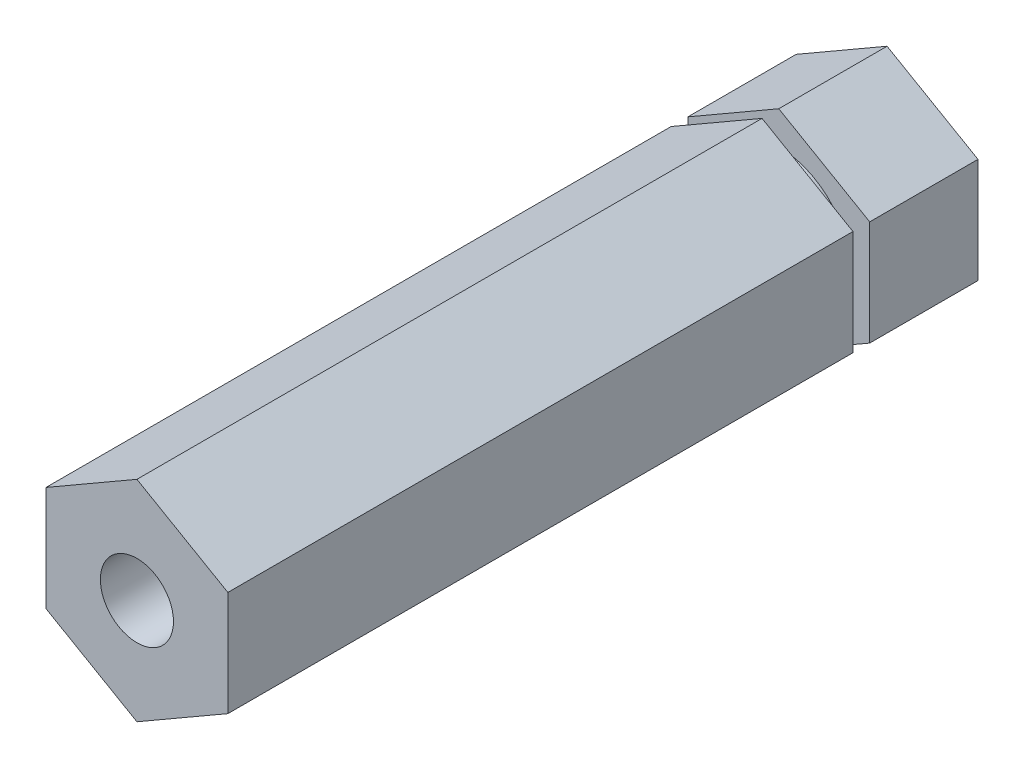
ISO-10303-21;
HEADER;
FILE_DESCRIPTION(('STEP AP214'),'2;1');
FILE_NAME('part.step','',(''),(''),'','','');
FILE_SCHEMA(('AUTOMOTIVE_DESIGN { 1 0 10303 214 1 1 1 1 }'));
ENDSEC;
DATA;
#1=APPLICATION_CONTEXT('core data for automotive mechanical design processes');
#2=APPLICATION_PROTOCOL_DEFINITION('international standard','automotive_design',2000,#1);
#3=PRODUCT_CONTEXT('',#1,'mechanical');
#4=PRODUCT('Part','Part','',(#3));
#5=PRODUCT_RELATED_PRODUCT_CATEGORY('part','',(#4));
#6=PRODUCT_DEFINITION_FORMATION('','',#4);
#7=PRODUCT_DEFINITION_CONTEXT('part definition',#1,'design');
#8=PRODUCT_DEFINITION('design','',#6,#7);
#9=PRODUCT_DEFINITION_SHAPE('','',#8);
#10=(LENGTH_UNIT() NAMED_UNIT(*) SI_UNIT(.MILLI.,.METRE.));
#11=(NAMED_UNIT(*) PLANE_ANGLE_UNIT() SI_UNIT($,.RADIAN.));
#12=(NAMED_UNIT(*) SI_UNIT($,.STERADIAN.) SOLID_ANGLE_UNIT());
#13=UNCERTAINTY_MEASURE_WITH_UNIT(LENGTH_MEASURE(1.E-05),#10,'distance_accuracy_value','');
#14=(GEOMETRIC_REPRESENTATION_CONTEXT(3) GLOBAL_UNCERTAINTY_ASSIGNED_CONTEXT((#13)) GLOBAL_UNIT_ASSIGNED_CONTEXT((#10,
#11,#12)) REPRESENTATION_CONTEXT('',''));
#15=CARTESIAN_POINT('',(0.,0.,0.));
#16=DIRECTION('',(0.,0.,1.));
#17=DIRECTION('',(1.,0.,0.));
#18=AXIS2_PLACEMENT_3D('',#15,#16,#17);
#19=CARTESIAN_POINT('',(0.,7.33234841870825,26.19375));
#20=DIRECTION('',(0.5,-0.866025403784438,0.));
#21=DIRECTION('',(0.866025403784439,0.5,0.));
#22=AXIS2_PLACEMENT_3D('',#19,#20,#21);
#23=PLANE('',#22);
#24=DIRECTION('',(0.,0.,-1.));
#25=VECTOR('',#24,1.);
#26=CARTESIAN_POINT('',(0.,7.33234841870825,26.19375));
#27=LINE('',#26,#25);
#28=CARTESIAN_POINT('',(0.,7.33234841870825,26.19375));
#29=VERTEX_POINT('',#28);
#30=CARTESIAN_POINT('',(0.,7.33234841870825,-17.4625));
#31=VERTEX_POINT('',#30);
#32=EDGE_CURVE('E146',#29,#31,#27,.T.);
#33=ORIENTED_EDGE('',*,*,#32,.T.);
#34=DIRECTION('',(-0.866025403784439,-0.5,0.));
#35=VECTOR('',#34,1.);
#36=CARTESIAN_POINT('',(0.,7.33234841870825,-17.4625));
#37=LINE('',#36,#35);
#38=CARTESIAN_POINT('',(-6.35,3.66617420935412,-17.4625));
#39=VERTEX_POINT('',#38);
#40=EDGE_CURVE('E60',#31,#39,#37,.T.);
#41=ORIENTED_EDGE('',*,*,#40,.T.);
#42=DIRECTION('',(0.,0.,-1.));
#43=VECTOR('',#42,1.);
#44=CARTESIAN_POINT('',(-6.35,3.66617420935412,26.19375));
#45=LINE('',#44,#43);
#46=CARTESIAN_POINT('',(-6.35,3.66617420935412,26.19375));
#47=VERTEX_POINT('',#46);
#48=EDGE_CURVE('E132',#47,#39,#45,.T.);
#49=ORIENTED_EDGE('',*,*,#48,.F.);
#50=DIRECTION('',(-0.866025403784438,-0.5,0.));
#51=VECTOR('',#50,1.);
#52=CARTESIAN_POINT('',(0.,7.33234841870825,26.19375));
#53=LINE('',#52,#51);
#54=EDGE_CURVE('E203',#29,#47,#53,.T.);
#55=ORIENTED_EDGE('',*,*,#54,.F.);
#56=EDGE_LOOP('',(#33,#41,#49,#55));
#57=FACE_BOUND('',#56,.T.);
#58=ADVANCED_FACE('F37',(#57),#23,.F.);
#59=CARTESIAN_POINT('',(-6.35,3.66617420935412,26.19375));
#60=DIRECTION('',(1.,0.,0.));
#61=DIRECTION('',(0.,0.,-1.));
#62=AXIS2_PLACEMENT_3D('',#59,#60,#61);
#63=PLANE('',#62);
#64=ORIENTED_EDGE('',*,*,#48,.T.);
#65=DIRECTION('',(0.,-1.,0.));
#66=VECTOR('',#65,1.);
#67=CARTESIAN_POINT('',(-6.35,3.66617420935413,-17.4625));
#68=LINE('',#67,#66);
#69=CARTESIAN_POINT('',(-6.35,-3.66617420935412,-17.4625));
#70=VERTEX_POINT('',#69);
#71=EDGE_CURVE('E228',#39,#70,#68,.T.);
#72=ORIENTED_EDGE('',*,*,#71,.T.);
#73=DIRECTION('',(0.,0.,-1.));
#74=VECTOR('',#73,1.);
#75=CARTESIAN_POINT('',(-6.35,-3.66617420935412,26.19375));
#76=LINE('',#75,#74);
#77=CARTESIAN_POINT('',(-6.35,-3.66617420935412,26.19375));
#78=VERTEX_POINT('',#77);
#79=EDGE_CURVE('E168',#78,#70,#76,.T.);
#80=ORIENTED_EDGE('',*,*,#79,.F.);
#81=DIRECTION('',(0.,-1.,0.));
#82=VECTOR('',#81,1.);
#83=CARTESIAN_POINT('',(-6.35,3.66617420935412,26.19375));
#84=LINE('',#83,#82);
#85=EDGE_CURVE('E205',#47,#78,#84,.T.);
#86=ORIENTED_EDGE('',*,*,#85,.F.);
#87=EDGE_LOOP('',(#64,#72,#80,#86));
#88=FACE_BOUND('',#87,.T.);
#89=ADVANCED_FACE('F273',(#88),#63,.F.);
#90=CARTESIAN_POINT('',(-6.35,-3.66617420935412,26.19375));
#91=DIRECTION('',(0.5,0.866025403784438,0.));
#92=DIRECTION('',(-0.866025403784439,0.5,0.));
#93=AXIS2_PLACEMENT_3D('',#90,#91,#92);
#94=PLANE('',#93);
#95=ORIENTED_EDGE('',*,*,#79,.T.);
#96=DIRECTION('',(0.866025403784439,-0.5,0.));
#97=VECTOR('',#96,1.);
#98=CARTESIAN_POINT('',(-6.35000000000001,-3.66617420935412,-17.4625));
#99=LINE('',#98,#97);
#100=CARTESIAN_POINT('',(0.,-7.33234841870825,-17.4625));
#101=VERTEX_POINT('',#100);
#102=EDGE_CURVE('E231',#70,#101,#99,.T.);
#103=ORIENTED_EDGE('',*,*,#102,.T.);
#104=DIRECTION('',(0.,0.,-1.));
#105=VECTOR('',#104,1.);
#106=CARTESIAN_POINT('',(0.,-7.33234841870825,26.19375));
#107=LINE('',#106,#105);
#108=CARTESIAN_POINT('',(0.,-7.33234841870825,26.19375));
#109=VERTEX_POINT('',#108);
#110=EDGE_CURVE('E164',#109,#101,#107,.T.);
#111=ORIENTED_EDGE('',*,*,#110,.F.);
#112=DIRECTION('',(0.866025403784439,-0.5,0.));
#113=VECTOR('',#112,1.);
#114=CARTESIAN_POINT('',(-6.35,-3.66617420935412,26.19375));
#115=LINE('',#114,#113);
#116=EDGE_CURVE('E209',#78,#109,#115,.T.);
#117=ORIENTED_EDGE('',*,*,#116,.F.);
#118=EDGE_LOOP('',(#95,#103,#111,#117));
#119=FACE_BOUND('',#118,.T.);
#120=ADVANCED_FACE('F271',(#119),#94,.F.);
#121=CARTESIAN_POINT('',(0.,-7.33234841870825,26.19375));
#122=DIRECTION('',(-0.5,0.866025403784438,0.));
#123=DIRECTION('',(-0.866025403784439,-0.5,0.));
#124=AXIS2_PLACEMENT_3D('',#121,#122,#123);
#125=PLANE('',#124);
#126=ORIENTED_EDGE('',*,*,#110,.T.);
#127=DIRECTION('',(0.866025403784439,0.5,0.));
#128=VECTOR('',#127,1.);
#129=CARTESIAN_POINT('',(0.,-7.33234841870824,-17.4625));
#130=LINE('',#129,#128);
#131=CARTESIAN_POINT('',(6.35,-3.66617420935412,-17.4625));
#132=VERTEX_POINT('',#131);
#133=EDGE_CURVE('E236',#101,#132,#130,.T.);
#134=ORIENTED_EDGE('',*,*,#133,.T.);
#135=DIRECTION('',(0.,0.,-1.));
#136=VECTOR('',#135,1.);
#137=CARTESIAN_POINT('',(6.35,-3.66617420935412,26.19375));
#138=LINE('',#137,#136);
#139=CARTESIAN_POINT('',(6.35,-3.66617420935412,26.19375));
#140=VERTEX_POINT('',#139);
#141=EDGE_CURVE('E160',#140,#132,#138,.T.);
#142=ORIENTED_EDGE('',*,*,#141,.F.);
#143=DIRECTION('',(0.866025403784438,0.5,0.));
#144=VECTOR('',#143,1.);
#145=CARTESIAN_POINT('',(0.,-7.33234841870825,26.19375));
#146=LINE('',#145,#144);
#147=EDGE_CURVE('E214',#109,#140,#146,.T.);
#148=ORIENTED_EDGE('',*,*,#147,.F.);
#149=EDGE_LOOP('',(#126,#134,#142,#148));
#150=FACE_BOUND('',#149,.T.);
#151=ADVANCED_FACE('F267',(#150),#125,.F.);
#152=CARTESIAN_POINT('',(6.35,-3.66617420935412,26.19375));
#153=DIRECTION('',(-1.,0.,0.));
#154=DIRECTION('',(0.,0.,1.));
#155=AXIS2_PLACEMENT_3D('',#152,#153,#154);
#156=PLANE('',#155);
#157=ORIENTED_EDGE('',*,*,#141,.T.);
#158=DIRECTION('',(0.,1.,0.));
#159=VECTOR('',#158,1.);
#160=CARTESIAN_POINT('',(6.35,-3.66617420935411,-17.4625));
#161=LINE('',#160,#159);
#162=CARTESIAN_POINT('',(6.35,3.66617420935413,-17.4625));
#163=VERTEX_POINT('',#162);
#164=EDGE_CURVE('E139',#132,#163,#161,.T.);
#165=ORIENTED_EDGE('',*,*,#164,.T.);
#166=DIRECTION('',(0.,0.,-1.));
#167=VECTOR('',#166,1.);
#168=CARTESIAN_POINT('',(6.35,3.66617420935413,26.19375));
#169=LINE('',#168,#167);
#170=CARTESIAN_POINT('',(6.35,3.66617420935413,26.19375));
#171=VERTEX_POINT('',#170);
#172=EDGE_CURVE('E156',#171,#163,#169,.T.);
#173=ORIENTED_EDGE('',*,*,#172,.F.);
#174=DIRECTION('',(0.,1.,0.));
#175=VECTOR('',#174,1.);
#176=CARTESIAN_POINT('',(6.35,-3.66617420935412,26.19375));
#177=LINE('',#176,#175);
#178=EDGE_CURVE('E151',#140,#171,#177,.T.);
#179=ORIENTED_EDGE('',*,*,#178,.F.);
#180=EDGE_LOOP('',(#157,#165,#173,#179));
#181=FACE_BOUND('',#180,.T.);
#182=ADVANCED_FACE('F224',(#181),#156,.F.);
#183=CARTESIAN_POINT('',(6.35,3.66617420935413,26.19375));
#184=DIRECTION('',(-0.5,-0.866025403784439,0.));
#185=DIRECTION('',(0.866025403784439,-0.5,0.));
#186=AXIS2_PLACEMENT_3D('',#183,#184,#185);
#187=PLANE('',#186);
#188=ORIENTED_EDGE('',*,*,#172,.T.);
#189=DIRECTION('',(-0.866025403784439,0.5,0.));
#190=VECTOR('',#189,1.);
#191=CARTESIAN_POINT('',(6.34999999999999,3.66617420935413,-17.4625));
#192=LINE('',#191,#190);
#193=EDGE_CURVE('E11',#163,#31,#192,.T.);
#194=ORIENTED_EDGE('',*,*,#193,.T.);
#195=ORIENTED_EDGE('',*,*,#32,.F.);
#196=DIRECTION('',(-0.866025403784439,0.5,0.));
#197=VECTOR('',#196,1.);
#198=CARTESIAN_POINT('',(6.35,3.66617420935413,26.19375));
#199=LINE('',#198,#197);
#200=EDGE_CURVE('E147',#171,#29,#199,.T.);
#201=ORIENTED_EDGE('',*,*,#200,.F.);
#202=EDGE_LOOP('',(#188,#194,#195,#201));
#203=FACE_BOUND('',#202,.T.);
#204=ADVANCED_FACE('F226',(#203),#187,.F.);
#205=CARTESIAN_POINT('',(0.,0.,26.19375));
#206=DIRECTION('',(0.,0.,1.));
#207=DIRECTION('',(1.,0.,0.));
#208=AXIS2_PLACEMENT_3D('',#205,#206,#207);
#209=PLANE('',#208);
#210=CARTESIAN_POINT('',(0.,0.,26.19375));
#211=DIRECTION('',(0.,0.,1.));
#212=DIRECTION('',(1.,0.,0.));
#213=AXIS2_PLACEMENT_3D('',#210,#211,#212);
#214=CIRCLE('',#213,2.55269999999999);
#215=CARTESIAN_POINT('',(2.55269999999999,0.,26.19375));
#216=VERTEX_POINT('',#215);
#217=EDGE_CURVE('E192',#216,#216,#214,.T.);
#218=ORIENTED_EDGE('',*,*,#217,.F.);
#219=EDGE_LOOP('',(#218));
#220=FACE_BOUND('',#219,.T.);
#221=ORIENTED_EDGE('',*,*,#54,.T.);
#222=ORIENTED_EDGE('',*,*,#85,.T.);
#223=ORIENTED_EDGE('',*,*,#116,.T.);
#224=ORIENTED_EDGE('',*,*,#147,.T.);
#225=ORIENTED_EDGE('',*,*,#178,.T.);
#226=ORIENTED_EDGE('',*,*,#200,.T.);
#227=EDGE_LOOP('',(#221,#222,#223,#224,#225,#226));
#228=FACE_BOUND('',#227,.T.);
#229=ADVANCED_FACE('F217',(#220,#228),#209,.T.);
#230=CARTESIAN_POINT('',(0.,0.,7.14375));
#231=DIRECTION('',(0.,0.,1.));
#232=DIRECTION('',(1.,0.,0.));
#233=AXIS2_PLACEMENT_3D('',#230,#231,#232);
#234=CONICAL_SURFACE('',#233,2.5527,1.02974425867665);
#235=CARTESIAN_POINT('',(0.,0.,5.60993309780835));
#236=VERTEX_POINT('',#235);
#237=VERTEX_LOOP('',#236);
#238=FACE_BOUND('',#237,.T.);
#239=CARTESIAN_POINT('',(0.,0.,7.14375));
#240=DIRECTION('',(0.,0.,1.));
#241=DIRECTION('',(1.,0.,0.));
#242=AXIS2_PLACEMENT_3D('',#239,#240,#241);
#243=CIRCLE('',#242,2.5527);
#244=CARTESIAN_POINT('',(2.5527,0.,7.14375));
#245=VERTEX_POINT('',#244);
#246=EDGE_CURVE('E189',#245,#245,#243,.T.);
#247=ORIENTED_EDGE('',*,*,#246,.T.);
#248=EDGE_LOOP('',(#247));
#249=FACE_BOUND('',#248,.T.);
#250=ADVANCED_FACE('F304',(#238,#249),#234,.F.);
#251=CARTESIAN_POINT('',(0.,0.,26.19375));
#252=DIRECTION('',(0.,0.,1.));
#253=DIRECTION('',(1.,0.,0.));
#254=AXIS2_PLACEMENT_3D('',#251,#252,#253);
#255=CYLINDRICAL_SURFACE('',#254,2.55269999999999);
#256=ORIENTED_EDGE('',*,*,#246,.F.);
#257=EDGE_LOOP('',(#256));
#258=FACE_BOUND('',#257,.T.);
#259=ORIENTED_EDGE('',*,*,#217,.T.);
#260=EDGE_LOOP('',(#259));
#261=FACE_BOUND('',#260,.T.);
#262=ADVANCED_FACE('F264',(#258,#261),#255,.F.);
#263=CARTESIAN_POINT('',(0.,9.87234841870825,-17.4625));
#264=DIRECTION('',(0.,0.,1.));
#265=DIRECTION('',(0.,-1.,0.));
#266=AXIS2_PLACEMENT_3D('',#263,#264,#265);
#267=PLANE('',#266);
#268=CARTESIAN_POINT('',(0.,0.,-17.4625));
#269=DIRECTION('',(0.,0.,-1.));
#270=DIRECTION('',(0.,1.,0.));
#271=AXIS2_PLACEMENT_3D('',#268,#269,#270);
#272=CIRCLE('',#271,5.0292);
#273=CARTESIAN_POINT('',(0.,5.0292,-17.4625));
#274=VERTEX_POINT('',#273);
#275=EDGE_CURVE('E248',#274,#274,#272,.T.);
#276=ORIENTED_EDGE('',*,*,#275,.F.);
#277=EDGE_LOOP('',(#276));
#278=FACE_BOUND('',#277,.T.);
#279=ORIENTED_EDGE('',*,*,#193,.F.);
#280=ORIENTED_EDGE('',*,*,#164,.F.);
#281=ORIENTED_EDGE('',*,*,#133,.F.);
#282=ORIENTED_EDGE('',*,*,#102,.F.);
#283=ORIENTED_EDGE('',*,*,#71,.F.);
#284=ORIENTED_EDGE('',*,*,#40,.F.);
#285=EDGE_LOOP('',(#279,#280,#281,#282,#283,#284));
#286=FACE_BOUND('',#285,.T.);
#287=ADVANCED_FACE('F262',(#278,#286),#267,.F.);
#288=CARTESIAN_POINT('',(0.,9.87234841870825,-18.6309));
#289=DIRECTION('',(0.,0.,-1.));
#290=DIRECTION('',(0.,1.,0.));
#291=AXIS2_PLACEMENT_3D('',#288,#289,#290);
#292=PLANE('',#291);
#293=CARTESIAN_POINT('',(0.,0.,-18.6309));
#294=DIRECTION('',(0.,0.,-1.));
#295=DIRECTION('',(0.,1.,0.));
#296=AXIS2_PLACEMENT_3D('',#293,#294,#295);
#297=CIRCLE('',#296,5.0292);
#298=CARTESIAN_POINT('',(0.,5.0292,-18.6309));
#299=VERTEX_POINT('',#298);
#300=EDGE_CURVE('E251',#299,#299,#297,.T.);
#301=ORIENTED_EDGE('',*,*,#300,.T.);
#302=EDGE_LOOP('',(#301));
#303=FACE_BOUND('',#302,.T.);
#304=DIRECTION('',(0.,1.,0.));
#305=VECTOR('',#304,1.);
#306=CARTESIAN_POINT('',(-6.35,3.66617420935414,-18.6309));
#307=LINE('',#306,#305);
#308=CARTESIAN_POINT('',(-6.35,-3.66617420935412,-18.6309));
#309=VERTEX_POINT('',#308);
#310=CARTESIAN_POINT('',(-6.35,3.66617420935412,-18.6309));
#311=VERTEX_POINT('',#310);
#312=EDGE_CURVE('E140',#309,#311,#307,.T.);
#313=ORIENTED_EDGE('',*,*,#312,.F.);
#314=DIRECTION('',(-0.866025403784439,0.5,0.));
#315=VECTOR('',#314,1.);
#316=CARTESIAN_POINT('',(-6.35000000000001,-3.66617420935412,-18.6309));
#317=LINE('',#316,#315);
#318=CARTESIAN_POINT('',(0.,-7.33234841870825,-18.6309));
#319=VERTEX_POINT('',#318);
#320=EDGE_CURVE('E241',#319,#309,#317,.T.);
#321=ORIENTED_EDGE('',*,*,#320,.F.);
#322=DIRECTION('',(-0.866025403784439,-0.5,0.));
#323=VECTOR('',#322,1.);
#324=CARTESIAN_POINT('',(0.,-7.33234841870824,-18.6309));
#325=LINE('',#324,#323);
#326=CARTESIAN_POINT('',(6.35,-3.66617420935412,-18.6309));
#327=VERTEX_POINT('',#326);
#328=EDGE_CURVE('E244',#327,#319,#325,.T.);
#329=ORIENTED_EDGE('',*,*,#328,.F.);
#330=DIRECTION('',(0.,-1.,0.));
#331=VECTOR('',#330,1.);
#332=CARTESIAN_POINT('',(6.35,-3.66617420935411,-18.6309));
#333=LINE('',#332,#331);
#334=CARTESIAN_POINT('',(6.35,3.66617420935413,-18.6309));
#335=VERTEX_POINT('',#334);
#336=EDGE_CURVE('E52',#335,#327,#333,.T.);
#337=ORIENTED_EDGE('',*,*,#336,.F.);
#338=DIRECTION('',(0.866025403784439,-0.5,0.));
#339=VECTOR('',#338,1.);
#340=CARTESIAN_POINT('',(6.34999999999999,3.66617420935413,-18.6309));
#341=LINE('',#340,#339);
#342=CARTESIAN_POINT('',(0.,7.33234841870825,-18.6309));
#343=VERTEX_POINT('',#342);
#344=EDGE_CURVE('E45',#343,#335,#341,.T.);
#345=ORIENTED_EDGE('',*,*,#344,.F.);
#346=DIRECTION('',(0.866025403784439,0.5,0.));
#347=VECTOR('',#346,1.);
#348=CARTESIAN_POINT('',(0.,7.33234841870825,-18.6309));
#349=LINE('',#348,#347);
#350=EDGE_CURVE('E127',#311,#343,#349,.T.);
#351=ORIENTED_EDGE('',*,*,#350,.F.);
#352=EDGE_LOOP('',(#313,#321,#329,#337,#345,#351));
#353=FACE_BOUND('',#352,.T.);
#354=ADVANCED_FACE('F126',(#303,#353),#292,.F.);
#355=CARTESIAN_POINT('',(0.,0.,-26.19375));
#356=DIRECTION('',(0.,0.,-1.));
#357=DIRECTION('',(0.,1.,0.));
#358=AXIS2_PLACEMENT_3D('',#355,#356,#357);
#359=CYLINDRICAL_SURFACE('',#358,5.0292);
#360=ORIENTED_EDGE('',*,*,#300,.F.);
#361=EDGE_LOOP('',(#360));
#362=FACE_BOUND('',#361,.T.);
#363=ORIENTED_EDGE('',*,*,#275,.T.);
#364=EDGE_LOOP('',(#363));
#365=FACE_BOUND('',#364,.T.);
#366=ADVANCED_FACE('F256',(#362,#365),#359,.T.);
#367=CARTESIAN_POINT('',(0.,0.,-26.19375));
#368=DIRECTION('',(0.,0.,1.));
#369=DIRECTION('',(1.,0.,0.));
#370=AXIS2_PLACEMENT_3D('',#367,#368,#369);
#371=PLANE('',#370);
#372=DIRECTION('',(-0.866025403784438,-0.5,0.));
#373=VECTOR('',#372,1.);
#374=CARTESIAN_POINT('',(0.,7.33234841870825,-26.19375));
#375=LINE('',#374,#373);
#376=CARTESIAN_POINT('',(0.,7.33234841870825,-26.19375));
#377=VERTEX_POINT('',#376);
#378=CARTESIAN_POINT('',(-6.35,3.66617420935412,-26.19375));
#379=VERTEX_POINT('',#378);
#380=EDGE_CURVE('E184',#377,#379,#375,.T.);
#381=ORIENTED_EDGE('',*,*,#380,.F.);
#382=DIRECTION('',(-0.866025403784439,0.5,0.));
#383=VECTOR('',#382,1.);
#384=CARTESIAN_POINT('',(6.35,3.66617420935413,-26.19375));
#385=LINE('',#384,#383);
#386=CARTESIAN_POINT('',(6.35,3.66617420935413,-26.19375));
#387=VERTEX_POINT('',#386);
#388=EDGE_CURVE('E144',#387,#377,#385,.T.);
#389=ORIENTED_EDGE('',*,*,#388,.F.);
#390=DIRECTION('',(0.,1.,0.));
#391=VECTOR('',#390,1.);
#392=CARTESIAN_POINT('',(6.35,-3.66617420935412,-26.19375));
#393=LINE('',#392,#391);
#394=CARTESIAN_POINT('',(6.35,-3.66617420935412,-26.19375));
#395=VERTEX_POINT('',#394);
#396=EDGE_CURVE('E199',#395,#387,#393,.T.);
#397=ORIENTED_EDGE('',*,*,#396,.F.);
#398=DIRECTION('',(0.866025403784438,0.5,0.));
#399=VECTOR('',#398,1.);
#400=CARTESIAN_POINT('',(0.,-7.33234841870825,-26.19375));
#401=LINE('',#400,#399);
#402=CARTESIAN_POINT('',(0.,-7.33234841870825,-26.19375));
#403=VERTEX_POINT('',#402);
#404=EDGE_CURVE('E197',#403,#395,#401,.T.);
#405=ORIENTED_EDGE('',*,*,#404,.F.);
#406=DIRECTION('',(0.866025403784439,-0.5,0.));
#407=VECTOR('',#406,1.);
#408=CARTESIAN_POINT('',(-6.35,-3.66617420935412,-26.19375));
#409=LINE('',#408,#407);
#410=CARTESIAN_POINT('',(-6.35,-3.66617420935412,-26.19375));
#411=VERTEX_POINT('',#410);
#412=EDGE_CURVE('E187',#411,#403,#409,.T.);
#413=ORIENTED_EDGE('',*,*,#412,.F.);
#414=DIRECTION('',(0.,-1.,0.));
#415=VECTOR('',#414,1.);
#416=CARTESIAN_POINT('',(-6.35,3.66617420935412,-26.19375));
#417=LINE('',#416,#415);
#418=EDGE_CURVE('E180',#379,#411,#417,.T.);
#419=ORIENTED_EDGE('',*,*,#418,.F.);
#420=EDGE_LOOP('',(#381,#389,#397,#405,#413,#419));
#421=FACE_BOUND('',#420,.T.);
#422=ADVANCED_FACE('F183',(#421),#371,.F.);
#423=EDGE_CURVE('E136',#343,#377,#27,.T.);
#424=ORIENTED_EDGE('',*,*,#423,.F.);
#425=ORIENTED_EDGE('',*,*,#344,.T.);
#426=EDGE_CURVE('E150',#335,#387,#169,.T.);
#427=ORIENTED_EDGE('',*,*,#426,.T.);
#428=ORIENTED_EDGE('',*,*,#388,.T.);
#429=EDGE_LOOP('',(#424,#425,#427,#428));
#430=FACE_BOUND('',#429,.T.);
#431=ADVANCED_FACE('F142',(#430),#187,.F.);
#432=ORIENTED_EDGE('',*,*,#426,.F.);
#433=ORIENTED_EDGE('',*,*,#336,.T.);
#434=EDGE_CURVE('E159',#327,#395,#138,.T.);
#435=ORIENTED_EDGE('',*,*,#434,.T.);
#436=ORIENTED_EDGE('',*,*,#396,.T.);
#437=EDGE_LOOP('',(#432,#433,#435,#436));
#438=FACE_BOUND('',#437,.T.);
#439=ADVANCED_FACE('F291',(#438),#156,.F.);
#440=ORIENTED_EDGE('',*,*,#434,.F.);
#441=ORIENTED_EDGE('',*,*,#328,.T.);
#442=EDGE_CURVE('E163',#319,#403,#107,.T.);
#443=ORIENTED_EDGE('',*,*,#442,.T.);
#444=ORIENTED_EDGE('',*,*,#404,.T.);
#445=EDGE_LOOP('',(#440,#441,#443,#444));
#446=FACE_BOUND('',#445,.T.);
#447=ADVANCED_FACE('F286',(#446),#125,.F.);
#448=ORIENTED_EDGE('',*,*,#442,.F.);
#449=ORIENTED_EDGE('',*,*,#320,.T.);
#450=EDGE_CURVE('E167',#309,#411,#76,.T.);
#451=ORIENTED_EDGE('',*,*,#450,.T.);
#452=ORIENTED_EDGE('',*,*,#412,.T.);
#453=EDGE_LOOP('',(#448,#449,#451,#452));
#454=FACE_BOUND('',#453,.T.);
#455=ADVANCED_FACE('F280',(#454),#94,.F.);
#456=ORIENTED_EDGE('',*,*,#450,.F.);
#457=ORIENTED_EDGE('',*,*,#312,.T.);
#458=EDGE_CURVE('E138',#311,#379,#45,.T.);
#459=ORIENTED_EDGE('',*,*,#458,.T.);
#460=ORIENTED_EDGE('',*,*,#418,.T.);
#461=EDGE_LOOP('',(#456,#457,#459,#460));
#462=FACE_BOUND('',#461,.T.);
#463=ADVANCED_FACE('F179',(#462),#63,.F.);
#464=ORIENTED_EDGE('',*,*,#458,.F.);
#465=ORIENTED_EDGE('',*,*,#350,.T.);
#466=ORIENTED_EDGE('',*,*,#423,.T.);
#467=ORIENTED_EDGE('',*,*,#380,.T.);
#468=EDGE_LOOP('',(#464,#465,#466,#467));
#469=FACE_BOUND('',#468,.T.);
#470=ADVANCED_FACE('F39',(#469),#23,.F.);
#471=CLOSED_SHELL('',(#58,#89,#120,#151,#182,#204,#229,#250,#262,#287,#354,#366,#422,#431,#439,
#447,#455,#463,#470));
#472=MANIFOLD_SOLID_BREP('B2',#471);
#473=ADVANCED_BREP_SHAPE_REPRESENTATION('',(#18,#472),#14);
#474=SHAPE_DEFINITION_REPRESENTATION(#9,#473);
ENDSEC;
END-ISO-10303-21;
